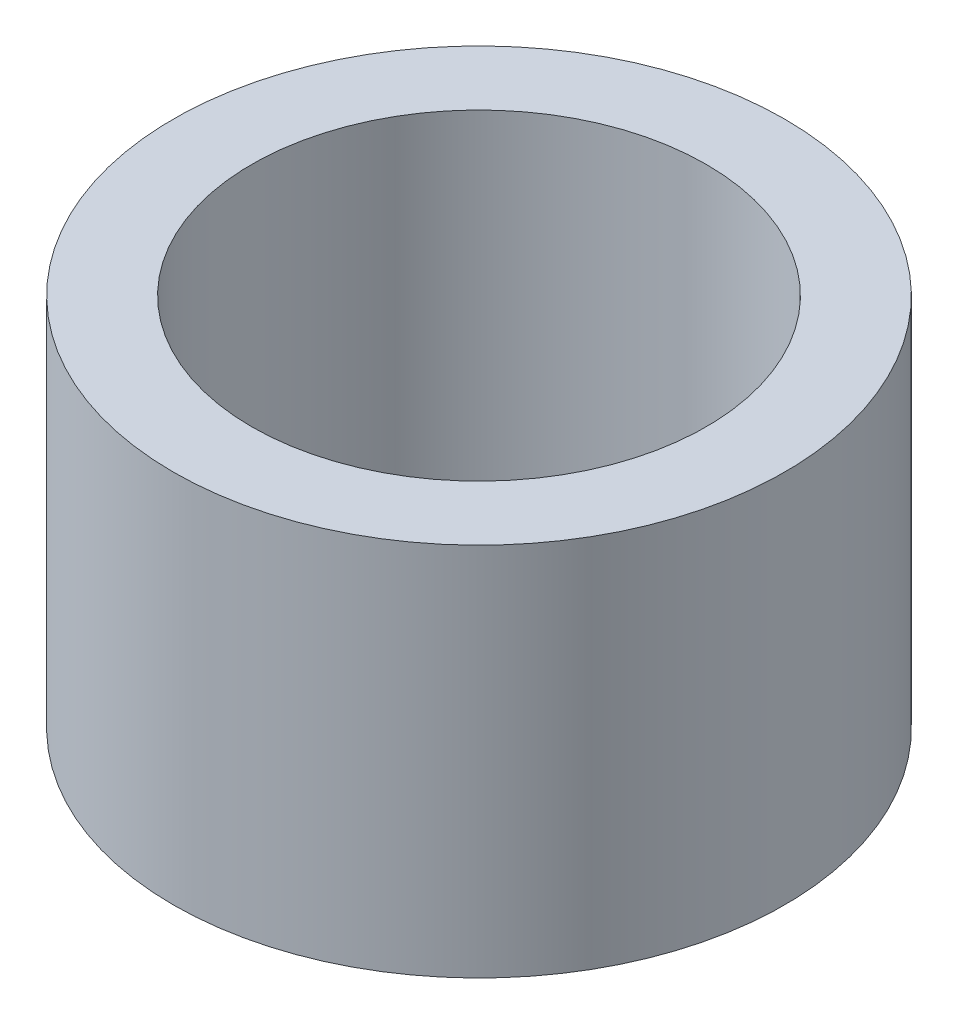
ISO-10303-21;
HEADER;
FILE_DESCRIPTION(('STEP AP214'),'2;1');
FILE_NAME('part.step','',(''),(''),'','','');
FILE_SCHEMA(('AUTOMOTIVE_DESIGN { 1 0 10303 214 1 1 1 1 }'));
ENDSEC;
DATA;
#1=APPLICATION_CONTEXT('core data for automotive mechanical design processes');
#2=APPLICATION_PROTOCOL_DEFINITION('international standard','automotive_design',2000,#1);
#3=PRODUCT_CONTEXT('',#1,'mechanical');
#4=PRODUCT('Part','Part','',(#3));
#5=PRODUCT_RELATED_PRODUCT_CATEGORY('part','',(#4));
#6=PRODUCT_DEFINITION_FORMATION('','',#4);
#7=PRODUCT_DEFINITION_CONTEXT('part definition',#1,'design');
#8=PRODUCT_DEFINITION('design','',#6,#7);
#9=PRODUCT_DEFINITION_SHAPE('','',#8);
#10=(LENGTH_UNIT() NAMED_UNIT(*) SI_UNIT(.MILLI.,.METRE.));
#11=(NAMED_UNIT(*) PLANE_ANGLE_UNIT() SI_UNIT($,.RADIAN.));
#12=(NAMED_UNIT(*) SI_UNIT($,.STERADIAN.) SOLID_ANGLE_UNIT());
#13=UNCERTAINTY_MEASURE_WITH_UNIT(LENGTH_MEASURE(1.E-05),#10,'distance_accuracy_value','');
#14=(GEOMETRIC_REPRESENTATION_CONTEXT(3) GLOBAL_UNCERTAINTY_ASSIGNED_CONTEXT((#13)) GLOBAL_UNIT_ASSIGNED_CONTEXT((#10,
#11,#12)) REPRESENTATION_CONTEXT('',''));
#15=CARTESIAN_POINT('',(0.,0.,0.));
#16=DIRECTION('',(0.,0.,1.));
#17=DIRECTION('',(1.,0.,0.));
#18=AXIS2_PLACEMENT_3D('',#15,#16,#17);
#19=CARTESIAN_POINT('',(0.,30.6543866283511,0.));
#20=DIRECTION('',(0.,-1.,0.));
#21=DIRECTION('',(0.,0.,-1.));
#22=AXIS2_PLACEMENT_3D('',#19,#20,#21);
#23=CYLINDRICAL_SURFACE('',#22,25.);
#24=CARTESIAN_POINT('',(0.,30.6543866283511,0.));
#25=DIRECTION('',(0.,1.,0.));
#26=DIRECTION('',(0.,0.,1.));
#27=AXIS2_PLACEMENT_3D('',#24,#25,#26);
#28=CIRCLE('',#27,25.);
#29=CARTESIAN_POINT('',(0.,30.6543866283511,25.));
#30=VERTEX_POINT('',#29);
#31=EDGE_CURVE('E10',#30,#30,#28,.T.);
#32=ORIENTED_EDGE('',*,*,#31,.F.);
#33=EDGE_LOOP('',(#32));
#34=FACE_BOUND('',#33,.T.);
#35=CARTESIAN_POINT('',(0.,0.,0.));
#36=DIRECTION('',(0.,1.,0.));
#37=DIRECTION('',(0.,0.,1.));
#38=AXIS2_PLACEMENT_3D('',#35,#36,#37);
#39=CIRCLE('',#38,25.);
#40=CARTESIAN_POINT('',(0.,0.,25.));
#41=VERTEX_POINT('',#40);
#42=EDGE_CURVE('E37',#41,#41,#39,.T.);
#43=ORIENTED_EDGE('',*,*,#42,.T.);
#44=EDGE_LOOP('',(#43));
#45=FACE_BOUND('',#44,.T.);
#46=ADVANCED_FACE('F40',(#34,#45),#23,.T.);
#47=CARTESIAN_POINT('',(0.,30.6543866283511,0.));
#48=DIRECTION('',(0.,1.,0.));
#49=DIRECTION('',(0.,0.,1.));
#50=AXIS2_PLACEMENT_3D('',#47,#48,#49);
#51=PLANE('',#50);
#52=CARTESIAN_POINT('',(0.,30.6543866283511,0.));
#53=DIRECTION('',(0.,1.,0.));
#54=DIRECTION('',(0.,0.,1.));
#55=AXIS2_PLACEMENT_3D('',#52,#53,#54);
#56=CIRCLE('',#55,18.5871223730712);
#57=CARTESIAN_POINT('',(0.,30.6543866283511,18.5871223730712));
#58=VERTEX_POINT('',#57);
#59=EDGE_CURVE('E50',#58,#58,#56,.T.);
#60=ORIENTED_EDGE('',*,*,#59,.F.);
#61=EDGE_LOOP('',(#60));
#62=FACE_BOUND('',#61,.T.);
#63=ORIENTED_EDGE('',*,*,#31,.T.);
#64=EDGE_LOOP('',(#63));
#65=FACE_BOUND('',#64,.T.);
#66=ADVANCED_FACE('F59',(#62,#65),#51,.T.);
#67=CARTESIAN_POINT('',(0.,0.,0.));
#68=DIRECTION('',(0.,1.,0.));
#69=DIRECTION('',(0.,0.,1.));
#70=AXIS2_PLACEMENT_3D('',#67,#68,#69);
#71=PLANE('',#70);
#72=CARTESIAN_POINT('',(0.,0.,0.));
#73=DIRECTION('',(0.,1.,0.));
#74=DIRECTION('',(0.,0.,1.));
#75=AXIS2_PLACEMENT_3D('',#72,#73,#74);
#76=CIRCLE('',#75,18.5871223730712);
#77=CARTESIAN_POINT('',(0.,0.,18.5871223730712));
#78=VERTEX_POINT('',#77);
#79=EDGE_CURVE('E47',#78,#78,#76,.T.);
#80=ORIENTED_EDGE('',*,*,#79,.T.);
#81=EDGE_LOOP('',(#80));
#82=FACE_BOUND('',#81,.T.);
#83=ORIENTED_EDGE('',*,*,#42,.F.);
#84=EDGE_LOOP('',(#83));
#85=FACE_BOUND('',#84,.T.);
#86=ADVANCED_FACE('F58',(#82,#85),#71,.F.);
#87=CARTESIAN_POINT('',(0.,30.6543866283511,0.));
#88=DIRECTION('',(0.,-1.,0.));
#89=DIRECTION('',(0.,0.,-1.));
#90=AXIS2_PLACEMENT_3D('',#87,#88,#89);
#91=CYLINDRICAL_SURFACE('',#90,18.5871223730712);
#92=ORIENTED_EDGE('',*,*,#59,.T.);
#93=EDGE_LOOP('',(#92));
#94=FACE_BOUND('',#93,.T.);
#95=ORIENTED_EDGE('',*,*,#79,.F.);
#96=EDGE_LOOP('',(#95));
#97=FACE_BOUND('',#96,.T.);
#98=ADVANCED_FACE('F54',(#94,#97),#91,.F.);
#99=CLOSED_SHELL('',(#46,#66,#86,#98));
#100=MANIFOLD_SOLID_BREP('B2',#99);
#101=ADVANCED_BREP_SHAPE_REPRESENTATION('',(#18,#100),#14);
#102=SHAPE_DEFINITION_REPRESENTATION(#9,#101);
ENDSEC;
END-ISO-10303-21;
